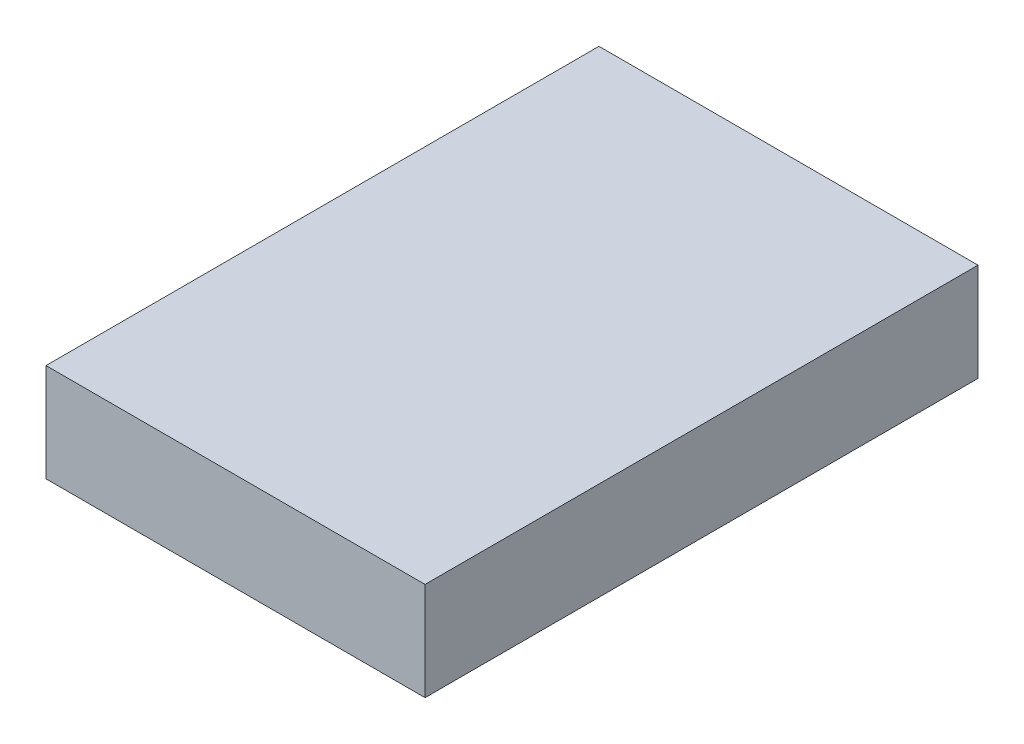
ISO-10303-21;
HEADER;
FILE_DESCRIPTION(('STEP AP214'),'2;1');
FILE_NAME('part.step','',(''),(''),'','','');
FILE_SCHEMA(('AUTOMOTIVE_DESIGN { 1 0 10303 214 1 1 1 1 }'));
ENDSEC;
DATA;
#1=APPLICATION_CONTEXT('core data for automotive mechanical design processes');
#2=APPLICATION_PROTOCOL_DEFINITION('international standard','automotive_design',2000,#1);
#3=PRODUCT_CONTEXT('',#1,'mechanical');
#4=PRODUCT('Part','Part','',(#3));
#5=PRODUCT_RELATED_PRODUCT_CATEGORY('part','',(#4));
#6=PRODUCT_DEFINITION_FORMATION('','',#4);
#7=PRODUCT_DEFINITION_CONTEXT('part definition',#1,'design');
#8=PRODUCT_DEFINITION('design','',#6,#7);
#9=PRODUCT_DEFINITION_SHAPE('','',#8);
#10=(LENGTH_UNIT() NAMED_UNIT(*) SI_UNIT(.MILLI.,.METRE.));
#11=(NAMED_UNIT(*) PLANE_ANGLE_UNIT() SI_UNIT($,.RADIAN.));
#12=(NAMED_UNIT(*) SI_UNIT($,.STERADIAN.) SOLID_ANGLE_UNIT());
#13=UNCERTAINTY_MEASURE_WITH_UNIT(LENGTH_MEASURE(1.E-05),#10,'distance_accuracy_value','');
#14=(GEOMETRIC_REPRESENTATION_CONTEXT(3) GLOBAL_UNCERTAINTY_ASSIGNED_CONTEXT((#13)) GLOBAL_UNIT_ASSIGNED_CONTEXT((#10,
#11,#12)) REPRESENTATION_CONTEXT('',''));
#15=CARTESIAN_POINT('',(0.,0.,0.));
#16=DIRECTION('',(0.,0.,1.));
#17=DIRECTION('',(1.,0.,0.));
#18=AXIS2_PLACEMENT_3D('',#15,#16,#17);
#19=CARTESIAN_POINT('',(42.5,22.,-62.));
#20=DIRECTION('',(-1.,0.,0.));
#21=DIRECTION('',(0.,0.,1.));
#22=AXIS2_PLACEMENT_3D('',#19,#20,#21);
#23=PLANE('',#22);
#24=DIRECTION('',(0.,0.,-1.));
#25=VECTOR('',#24,1.);
#26=CARTESIAN_POINT('',(42.5,0.,-62.));
#27=LINE('',#26,#25);
#28=CARTESIAN_POINT('',(42.5,0.,62.));
#29=VERTEX_POINT('',#28);
#30=CARTESIAN_POINT('',(42.5,0.,-62.));
#31=VERTEX_POINT('',#30);
#32=EDGE_CURVE('E97',#29,#31,#27,.T.);
#33=ORIENTED_EDGE('',*,*,#32,.T.);
#34=DIRECTION('',(0.,-1.,0.));
#35=VECTOR('',#34,1.);
#36=CARTESIAN_POINT('',(42.5,22.,-62.));
#37=LINE('',#36,#35);
#38=CARTESIAN_POINT('',(42.5,22.,-62.));
#39=VERTEX_POINT('',#38);
#40=EDGE_CURVE('E11',#39,#31,#37,.T.);
#41=ORIENTED_EDGE('',*,*,#40,.F.);
#42=DIRECTION('',(0.,0.,-1.));
#43=VECTOR('',#42,1.);
#44=CARTESIAN_POINT('',(42.5,22.,-62.));
#45=LINE('',#44,#43);
#46=CARTESIAN_POINT('',(42.5,22.,62.));
#47=VERTEX_POINT('',#46);
#48=EDGE_CURVE('E85',#47,#39,#45,.T.);
#49=ORIENTED_EDGE('',*,*,#48,.F.);
#50=DIRECTION('',(0.,-1.,0.));
#51=VECTOR('',#50,1.);
#52=CARTESIAN_POINT('',(42.5,22.,62.));
#53=LINE('',#52,#51);
#54=EDGE_CURVE('E93',#47,#29,#53,.T.);
#55=ORIENTED_EDGE('',*,*,#54,.T.);
#56=EDGE_LOOP('',(#33,#41,#49,#55));
#57=FACE_BOUND('',#56,.T.);
#58=ADVANCED_FACE('F34',(#57),#23,.F.);
#59=CARTESIAN_POINT('',(-42.5,22.,-62.));
#60=DIRECTION('',(0.,0.,1.));
#61=DIRECTION('',(1.,0.,0.));
#62=AXIS2_PLACEMENT_3D('',#59,#60,#61);
#63=PLANE('',#62);
#64=DIRECTION('',(-1.,0.,0.));
#65=VECTOR('',#64,1.);
#66=CARTESIAN_POINT('',(-42.5,0.,-62.));
#67=LINE('',#66,#65);
#68=CARTESIAN_POINT('',(-42.5,0.,-62.));
#69=VERTEX_POINT('',#68);
#70=EDGE_CURVE('E89',#31,#69,#67,.T.);
#71=ORIENTED_EDGE('',*,*,#70,.T.);
#72=DIRECTION('',(0.,-1.,0.));
#73=VECTOR('',#72,1.);
#74=CARTESIAN_POINT('',(-42.5,22.,-62.));
#75=LINE('',#74,#73);
#76=CARTESIAN_POINT('',(-42.5,22.,-62.));
#77=VERTEX_POINT('',#76);
#78=EDGE_CURVE('E42',#77,#69,#75,.T.);
#79=ORIENTED_EDGE('',*,*,#78,.F.);
#80=DIRECTION('',(-1.,0.,0.));
#81=VECTOR('',#80,1.);
#82=CARTESIAN_POINT('',(-42.5,22.,-62.));
#83=LINE('',#82,#81);
#84=EDGE_CURVE('E80',#39,#77,#83,.T.);
#85=ORIENTED_EDGE('',*,*,#84,.F.);
#86=ORIENTED_EDGE('',*,*,#40,.T.);
#87=EDGE_LOOP('',(#71,#79,#85,#86));
#88=FACE_BOUND('',#87,.T.);
#89=ADVANCED_FACE('F88',(#88),#63,.F.);
#90=CARTESIAN_POINT('',(-42.5,22.,-62.));
#91=DIRECTION('',(1.,0.,0.));
#92=DIRECTION('',(0.,0.,-1.));
#93=AXIS2_PLACEMENT_3D('',#90,#91,#92);
#94=PLANE('',#93);
#95=DIRECTION('',(0.,0.,1.));
#96=VECTOR('',#95,1.);
#97=CARTESIAN_POINT('',(-42.5,0.,-62.));
#98=LINE('',#97,#96);
#99=CARTESIAN_POINT('',(-42.5,0.,62.));
#100=VERTEX_POINT('',#99);
#101=EDGE_CURVE('E67',#69,#100,#98,.T.);
#102=ORIENTED_EDGE('',*,*,#101,.T.);
#103=DIRECTION('',(0.,-1.,0.));
#104=VECTOR('',#103,1.);
#105=CARTESIAN_POINT('',(-42.5,22.,62.));
#106=LINE('',#105,#104);
#107=CARTESIAN_POINT('',(-42.5,22.,62.));
#108=VERTEX_POINT('',#107);
#109=EDGE_CURVE('E90',#108,#100,#106,.T.);
#110=ORIENTED_EDGE('',*,*,#109,.F.);
#111=DIRECTION('',(0.,0.,1.));
#112=VECTOR('',#111,1.);
#113=CARTESIAN_POINT('',(-42.5,22.,-62.));
#114=LINE('',#113,#112);
#115=EDGE_CURVE('E83',#77,#108,#114,.T.);
#116=ORIENTED_EDGE('',*,*,#115,.F.);
#117=ORIENTED_EDGE('',*,*,#78,.T.);
#118=EDGE_LOOP('',(#102,#110,#116,#117));
#119=FACE_BOUND('',#118,.T.);
#120=ADVANCED_FACE('F91',(#119),#94,.F.);
#121=CARTESIAN_POINT('',(-42.5,22.,62.));
#122=DIRECTION('',(0.,0.,-1.));
#123=DIRECTION('',(-1.,0.,0.));
#124=AXIS2_PLACEMENT_3D('',#121,#122,#123);
#125=PLANE('',#124);
#126=DIRECTION('',(1.,0.,0.));
#127=VECTOR('',#126,1.);
#128=CARTESIAN_POINT('',(-42.5,0.,62.));
#129=LINE('',#128,#127);
#130=EDGE_CURVE('E73',#100,#29,#129,.T.);
#131=ORIENTED_EDGE('',*,*,#130,.T.);
#132=ORIENTED_EDGE('',*,*,#54,.F.);
#133=DIRECTION('',(1.,0.,0.));
#134=VECTOR('',#133,1.);
#135=CARTESIAN_POINT('',(-42.5,22.,62.));
#136=LINE('',#135,#134);
#137=EDGE_CURVE('E50',#108,#47,#136,.T.);
#138=ORIENTED_EDGE('',*,*,#137,.F.);
#139=ORIENTED_EDGE('',*,*,#109,.T.);
#140=EDGE_LOOP('',(#131,#132,#138,#139));
#141=FACE_BOUND('',#140,.T.);
#142=ADVANCED_FACE('F104',(#141),#125,.F.);
#143=CARTESIAN_POINT('',(0.,22.,0.));
#144=DIRECTION('',(0.,1.,0.));
#145=DIRECTION('',(0.,0.,1.));
#146=AXIS2_PLACEMENT_3D('',#143,#144,#145);
#147=PLANE('',#146);
#148=ORIENTED_EDGE('',*,*,#48,.T.);
#149=ORIENTED_EDGE('',*,*,#84,.T.);
#150=ORIENTED_EDGE('',*,*,#115,.T.);
#151=ORIENTED_EDGE('',*,*,#137,.T.);
#152=EDGE_LOOP('',(#148,#149,#150,#151));
#153=FACE_BOUND('',#152,.T.);
#154=ADVANCED_FACE('F81',(#153),#147,.T.);
#155=CARTESIAN_POINT('',(0.,0.,0.));
#156=DIRECTION('',(0.,1.,0.));
#157=DIRECTION('',(0.,0.,1.));
#158=AXIS2_PLACEMENT_3D('',#155,#156,#157);
#159=PLANE('',#158);
#160=ORIENTED_EDGE('',*,*,#32,.F.);
#161=ORIENTED_EDGE('',*,*,#130,.F.);
#162=ORIENTED_EDGE('',*,*,#101,.F.);
#163=ORIENTED_EDGE('',*,*,#70,.F.);
#164=EDGE_LOOP('',(#160,#161,#162,#163));
#165=FACE_BOUND('',#164,.T.);
#166=ADVANCED_FACE('F107',(#165),#159,.F.);
#167=CLOSED_SHELL('',(#58,#89,#120,#142,#154,#166));
#168=MANIFOLD_SOLID_BREP('B2',#167);
#169=ADVANCED_BREP_SHAPE_REPRESENTATION('',(#18,#168),#14);
#170=SHAPE_DEFINITION_REPRESENTATION(#9,#169);
ENDSEC;
END-ISO-10303-21;
